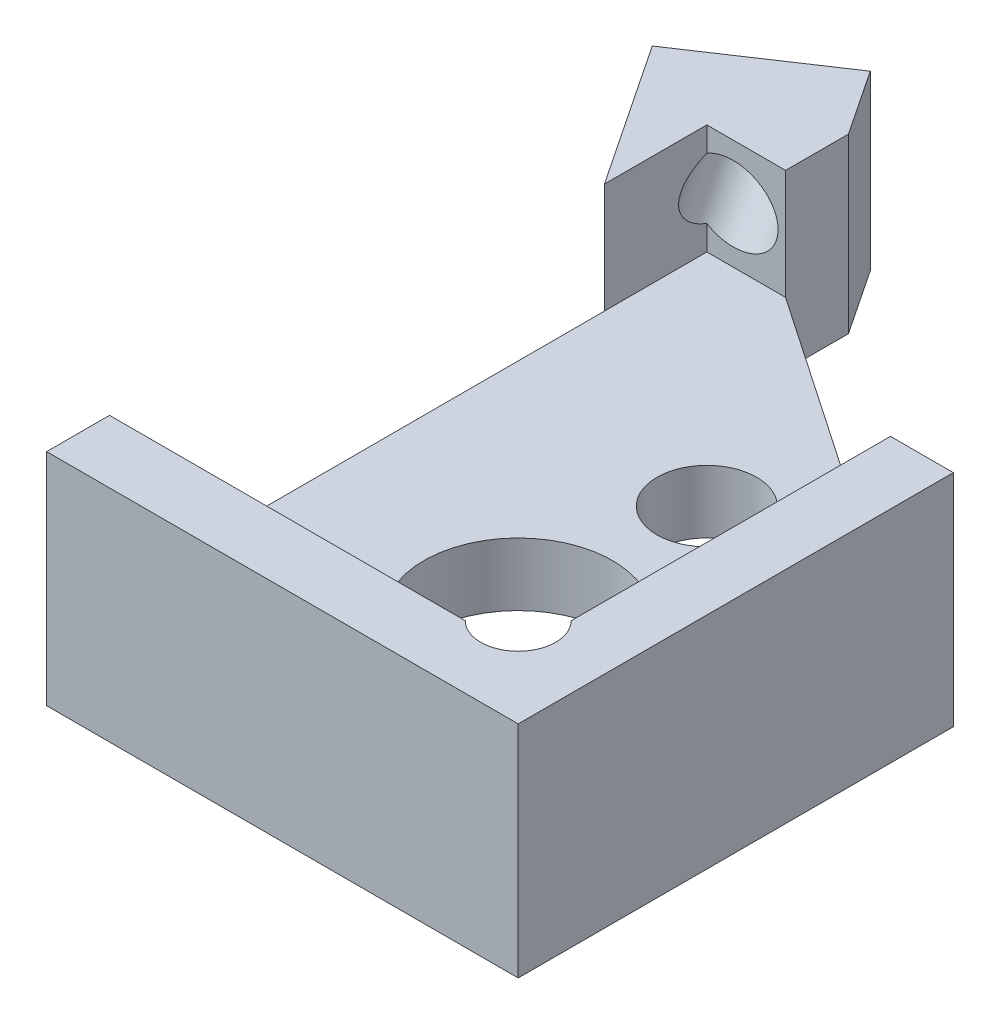
ISO-10303-21;
HEADER;
FILE_DESCRIPTION(('STEP AP214'),'2;1');
FILE_NAME('part.step','',(''),(''),'','','');
FILE_SCHEMA(('AUTOMOTIVE_DESIGN { 1 0 10303 214 1 1 1 1 }'));
ENDSEC;
DATA;
#1=APPLICATION_CONTEXT('core data for automotive mechanical design processes');
#2=APPLICATION_PROTOCOL_DEFINITION('international standard','automotive_design',2000,#1);
#3=PRODUCT_CONTEXT('',#1,'mechanical');
#4=PRODUCT('Part','Part','',(#3));
#5=PRODUCT_RELATED_PRODUCT_CATEGORY('part','',(#4));
#6=PRODUCT_DEFINITION_FORMATION('','',#4);
#7=PRODUCT_DEFINITION_CONTEXT('part definition',#1,'design');
#8=PRODUCT_DEFINITION('design','',#6,#7);
#9=PRODUCT_DEFINITION_SHAPE('','',#8);
#10=(LENGTH_UNIT() NAMED_UNIT(*) SI_UNIT(.MILLI.,.METRE.));
#11=(NAMED_UNIT(*) PLANE_ANGLE_UNIT() SI_UNIT($,.RADIAN.));
#12=(NAMED_UNIT(*) SI_UNIT($,.STERADIAN.) SOLID_ANGLE_UNIT());
#13=UNCERTAINTY_MEASURE_WITH_UNIT(LENGTH_MEASURE(1.E-05),#10,'distance_accuracy_value','');
#14=(GEOMETRIC_REPRESENTATION_CONTEXT(3) GLOBAL_UNCERTAINTY_ASSIGNED_CONTEXT((#13)) GLOBAL_UNIT_ASSIGNED_CONTEXT((#10,
#11,#12)) REPRESENTATION_CONTEXT('',''));
#15=CARTESIAN_POINT('',(0.,0.,0.));
#16=DIRECTION('',(0.,0.,1.));
#17=DIRECTION('',(1.,0.,0.));
#18=AXIS2_PLACEMENT_3D('',#15,#16,#17);
#19=CARTESIAN_POINT('',(4.25,3.5,5.75));
#20=DIRECTION('',(0.,0.,-1.));
#21=DIRECTION('',(-1.,0.,0.));
#22=AXIS2_PLACEMENT_3D('',#19,#20,#21);
#23=PLANE('',#22);
#24=DIRECTION('',(1.,0.,0.));
#25=VECTOR('',#24,1.);
#26=CARTESIAN_POINT('',(4.25,3.5,5.75));
#27=LINE('',#26,#25);
#28=CARTESIAN_POINT('',(-3.25,3.5,5.75));
#29=VERTEX_POINT('',#28);
#30=CARTESIAN_POINT('',(4.25,3.5,5.75));
#31=VERTEX_POINT('',#30);
#32=EDGE_CURVE('E282',#29,#31,#27,.T.);
#33=ORIENTED_EDGE('',*,*,#32,.F.);
#34=DIRECTION('',(0.,1.,0.));
#35=VECTOR('',#34,1.);
#36=CARTESIAN_POINT('',(-3.25,-0.001000000000001,5.75));
#37=LINE('',#36,#35);
#38=CARTESIAN_POINT('',(-3.25,0.,5.75));
#39=VERTEX_POINT('',#38);
#40=EDGE_CURVE('E173',#39,#29,#37,.T.);
#41=ORIENTED_EDGE('',*,*,#40,.F.);
#42=DIRECTION('',(1.,0.,0.));
#43=VECTOR('',#42,1.);
#44=CARTESIAN_POINT('',(4.25,0.,5.75));
#45=LINE('',#44,#43);
#46=CARTESIAN_POINT('',(4.25,0.,5.75));
#47=VERTEX_POINT('',#46);
#48=EDGE_CURVE('E170',#39,#47,#45,.T.);
#49=ORIENTED_EDGE('',*,*,#48,.T.);
#50=DIRECTION('',(0.,-1.,0.));
#51=VECTOR('',#50,1.);
#52=CARTESIAN_POINT('',(4.25,3.5,5.75));
#53=LINE('',#52,#51);
#54=EDGE_CURVE('E288',#31,#47,#53,.T.);
#55=ORIENTED_EDGE('',*,*,#54,.F.);
#56=EDGE_LOOP('',(#33,#41,#49,#55));
#57=FACE_BOUND('',#56,.T.);
#58=ADVANCED_FACE('F36',(#57),#23,.F.);
#59=CARTESIAN_POINT('',(4.25,3.5,-5.75));
#60=DIRECTION('',(-1.,0.,0.));
#61=DIRECTION('',(0.,0.,1.));
#62=AXIS2_PLACEMENT_3D('',#59,#60,#61);
#63=PLANE('',#62);
#64=DIRECTION('',(0.,0.,-1.));
#65=VECTOR('',#64,1.);
#66=CARTESIAN_POINT('',(4.25,0.,-5.75));
#67=LINE('',#66,#65);
#68=CARTESIAN_POINT('',(4.25,0.,-1.17080631760558));
#69=VERTEX_POINT('',#68);
#70=EDGE_CURVE('E285',#47,#69,#67,.T.);
#71=ORIENTED_EDGE('',*,*,#70,.T.);
#72=DIRECTION('',(0.,1.,0.));
#73=VECTOR('',#72,1.);
#74=CARTESIAN_POINT('',(4.25,-0.001000000000001,-1.17080631760558));
#75=LINE('',#74,#73);
#76=CARTESIAN_POINT('',(4.25,3.5,-1.17080631760558));
#77=VERTEX_POINT('',#76);
#78=EDGE_CURVE('E192',#69,#77,#75,.T.);
#79=ORIENTED_EDGE('',*,*,#78,.T.);
#80=DIRECTION('',(0.,0.,-1.));
#81=VECTOR('',#80,1.);
#82=CARTESIAN_POINT('',(4.25,3.5,-5.75));
#83=LINE('',#82,#81);
#84=EDGE_CURVE('E284',#31,#77,#83,.T.);
#85=ORIENTED_EDGE('',*,*,#84,.F.);
#86=ORIENTED_EDGE('',*,*,#54,.T.);
#87=EDGE_LOOP('',(#71,#79,#85,#86));
#88=FACE_BOUND('',#87,.T.);
#89=ADVANCED_FACE('F321',(#88),#63,.F.);
#90=CARTESIAN_POINT('',(0.,3.5,0.));
#91=DIRECTION('',(0.,-1.,0.));
#92=DIRECTION('',(0.,0.,-1.));
#93=AXIS2_PLACEMENT_3D('',#90,#91,#92);
#94=PLANE('',#93);
#95=DIRECTION('',(1.,0.,0.));
#96=VECTOR('',#95,1.);
#97=CARTESIAN_POINT('',(3.25,3.5,4.75));
#98=LINE('',#97,#96);
#99=CARTESIAN_POINT('',(-3.25,3.5,4.75));
#100=VERTEX_POINT('',#99);
#101=CARTESIAN_POINT('',(2.40810098864977,3.5,4.75));
#102=VERTEX_POINT('',#101);
#103=EDGE_CURVE('E256',#100,#102,#98,.T.);
#104=ORIENTED_EDGE('',*,*,#103,.F.);
#105=DIRECTION('',(0.,0.,-1.));
#106=VECTOR('',#105,1.);
#107=CARTESIAN_POINT('',(-3.25,3.5,-3.12166032803723));
#108=LINE('',#107,#106);
#109=EDGE_CURVE('E171',#29,#100,#108,.T.);
#110=ORIENTED_EDGE('',*,*,#109,.F.);
#111=ORIENTED_EDGE('',*,*,#32,.T.);
#112=ORIENTED_EDGE('',*,*,#84,.T.);
#113=DIRECTION('',(1.,0.,0.));
#114=VECTOR('',#113,1.);
#115=CARTESIAN_POINT('',(3.25,3.5,-1.17080631760558));
#116=LINE('',#115,#114);
#117=CARTESIAN_POINT('',(3.25,3.5,-1.17080631760558));
#118=VERTEX_POINT('',#117);
#119=EDGE_CURVE('E189',#118,#77,#116,.T.);
#120=ORIENTED_EDGE('',*,*,#119,.F.);
#121=DIRECTION('',(0.,0.,-1.));
#122=VECTOR('',#121,1.);
#123=CARTESIAN_POINT('',(3.25,3.5,-4.75));
#124=LINE('',#123,#122);
#125=CARTESIAN_POINT('',(3.25,3.5,3.90810098864977));
#126=VERTEX_POINT('',#125);
#127=EDGE_CURVE('E259',#126,#118,#124,.T.);
#128=ORIENTED_EDGE('',*,*,#127,.F.);
#129=CARTESIAN_POINT('',(2.82905049432488,3.5,4.32905049432488));
#130=DIRECTION('',(0.,1.,0.));
#131=DIRECTION('',(0.,0.,1.));
#132=AXIS2_PLACEMENT_3D('',#129,#130,#131);
#133=CIRCLE('',#132,0.595312500000001);
#134=EDGE_CURVE('E243',#102,#126,#133,.T.);
#135=ORIENTED_EDGE('',*,*,#134,.F.);
#136=EDGE_LOOP('',(#104,#110,#111,#112,#120,#128,#135));
#137=FACE_BOUND('',#136,.T.);
#138=ADVANCED_FACE('F329',(#137),#94,.F.);
#139=CARTESIAN_POINT('',(0.,0.,0.));
#140=DIRECTION('',(0.,-1.,0.));
#141=DIRECTION('',(0.,0.,-1.));
#142=AXIS2_PLACEMENT_3D('',#139,#140,#141);
#143=PLANE('',#142);
#144=DIRECTION('',(0.,0.,-1.));
#145=VECTOR('',#144,1.);
#146=CARTESIAN_POINT('',(-3.25,0.,-3.12166032803723));
#147=LINE('',#146,#145);
#148=CARTESIAN_POINT('',(-3.25,0.,-3.12166032803723));
#149=VERTEX_POINT('',#148);
#150=EDGE_CURVE('E160',#39,#149,#147,.T.);
#151=ORIENTED_EDGE('',*,*,#150,.T.);
#152=DIRECTION('',(0.55470019622523,0.,0.832050294337843));
#153=VECTOR('',#152,1.);
#154=CARTESIAN_POINT('',(-4.00154138705974,0.,-4.24897240862684));
#155=LINE('',#154,#153);
#156=CARTESIAN_POINT('',(-4.77077215629051,0.,-5.40281856247299));
#157=VERTEX_POINT('',#156);
#158=EDGE_CURVE('E146',#157,#149,#155,.T.);
#159=ORIENTED_EDGE('',*,*,#158,.F.);
#160=DIRECTION('',(-0.832050294337844,0.,0.554700196225229));
#161=VECTOR('',#160,1.);
#162=CARTESIAN_POINT('',(-2.6906464204459,0.,-6.78956905303607));
#163=LINE('',#162,#161);
#164=CARTESIAN_POINT('',(-2.6906464204459,0.,-6.78956905303607));
#165=VERTEX_POINT('',#164);
#166=EDGE_CURVE('E218',#165,#157,#163,.T.);
#167=ORIENTED_EDGE('',*,*,#166,.F.);
#168=DIRECTION('',(-0.554700196225229,0.,-0.832050294337844));
#169=VECTOR('',#168,1.);
#170=CARTESIAN_POINT('',(-2.6906464204459,0.,-6.78956905303607));
#171=LINE('',#170,#169);
#172=CARTESIAN_POINT('',(-1.99760038508853,0.,-5.75));
#173=VERTEX_POINT('',#172);
#174=EDGE_CURVE('E156',#173,#165,#171,.T.);
#175=ORIENTED_EDGE('',*,*,#174,.F.);
#176=DIRECTION('',(0.,0.,1.));
#177=VECTOR('',#176,1.);
#178=CARTESIAN_POINT('',(-1.99760038508852,0.,-5.75));
#179=LINE('',#178,#177);
#180=CARTESIAN_POINT('',(-1.99760038508852,0.,-4.75));
#181=VERTEX_POINT('',#180);
#182=EDGE_CURVE('E200',#173,#181,#179,.T.);
#183=ORIENTED_EDGE('',*,*,#182,.T.);
#184=DIRECTION('',(0.826133221814283,0.,0.563474843994613));
#185=VECTOR('',#184,1.);
#186=CARTESIAN_POINT('',(-1.99760038508852,0.,-4.75));
#187=LINE('',#186,#185);
#188=CARTESIAN_POINT('',(3.25,0.,-1.17080631760558));
#189=VERTEX_POINT('',#188);
#190=EDGE_CURVE('E183',#181,#189,#187,.T.);
#191=ORIENTED_EDGE('',*,*,#190,.T.);
#192=DIRECTION('',(1.,0.,0.));
#193=VECTOR('',#192,1.);
#194=CARTESIAN_POINT('',(3.25,0.,-1.17080631760558));
#195=LINE('',#194,#193);
#196=EDGE_CURVE('E186',#189,#69,#195,.T.);
#197=ORIENTED_EDGE('',*,*,#196,.T.);
#198=ORIENTED_EDGE('',*,*,#70,.F.);
#199=ORIENTED_EDGE('',*,*,#48,.F.);
#200=EDGE_LOOP('',(#151,#159,#167,#175,#183,#191,#197,#198,#199));
#201=FACE_BOUND('',#200,.T.);
#202=CARTESIAN_POINT('',(2.125,0.,3.5));
#203=DIRECTION('',(0.,1.,0.));
#204=DIRECTION('',(0.,0.,1.));
#205=AXIS2_PLACEMENT_3D('',#202,#203,#204);
#206=CIRCLE('',#205,0.79375);
#207=CARTESIAN_POINT('',(2.125,0.,4.29375));
#208=VERTEX_POINT('',#207);
#209=EDGE_CURVE('E228',#208,#208,#206,.T.);
#210=ORIENTED_EDGE('',*,*,#209,.T.);
#211=EDGE_LOOP('',(#210));
#212=FACE_BOUND('',#211,.T.);
#213=CARTESIAN_POINT('',(-1.625,0.,3.5));
#214=DIRECTION('',(0.,1.,0.));
#215=DIRECTION('',(0.,0.,1.));
#216=AXIS2_PLACEMENT_3D('',#213,#214,#215);
#217=CIRCLE('',#216,0.793750000000001);
#218=CARTESIAN_POINT('',(-1.625,0.,4.29375));
#219=VERTEX_POINT('',#218);
#220=EDGE_CURVE('E234',#219,#219,#217,.T.);
#221=ORIENTED_EDGE('',*,*,#220,.T.);
#222=EDGE_LOOP('',(#221));
#223=FACE_BOUND('',#222,.T.);
#224=CARTESIAN_POINT('',(0.250000000000001,0.,-1.25));
#225=DIRECTION('',(0.,1.,0.));
#226=DIRECTION('',(0.,0.,1.));
#227=AXIS2_PLACEMENT_3D('',#224,#225,#226);
#228=CIRCLE('',#227,0.79375);
#229=CARTESIAN_POINT('',(0.250000000000001,0.,-0.456249999999999));
#230=VERTEX_POINT('',#229);
#231=EDGE_CURVE('E240',#230,#230,#228,.T.);
#232=ORIENTED_EDGE('',*,*,#231,.T.);
#233=EDGE_LOOP('',(#232));
#234=FACE_BOUND('',#233,.T.);
#235=CARTESIAN_POINT('',(0.250000000000001,0.,1.75));
#236=DIRECTION('',(0.,1.,0.));
#237=DIRECTION('',(0.,0.,1.));
#238=AXIS2_PLACEMENT_3D('',#235,#236,#237);
#239=CIRCLE('',#238,1.5);
#240=CARTESIAN_POINT('',(0.250000000000001,0.,3.25));
#241=VERTEX_POINT('',#240);
#242=EDGE_CURVE('E253',#241,#241,#239,.T.);
#243=ORIENTED_EDGE('',*,*,#242,.T.);
#244=EDGE_LOOP('',(#243));
#245=FACE_BOUND('',#244,.T.);
#246=ADVANCED_FACE('F167',(#201,#212,#223,#234,#245),#143,.T.);
#247=CARTESIAN_POINT('',(0.,1.,0.));
#248=DIRECTION('',(0.,-1.,0.));
#249=DIRECTION('',(0.,0.,-1.));
#250=AXIS2_PLACEMENT_3D('',#247,#248,#249);
#251=PLANE('',#250);
#252=CARTESIAN_POINT('',(2.125,1.,3.5));
#253=DIRECTION('',(0.,1.,0.));
#254=DIRECTION('',(0.,0.,1.));
#255=AXIS2_PLACEMENT_3D('',#252,#253,#254);
#256=CIRCLE('',#255,0.79375);
#257=CARTESIAN_POINT('',(2.125,1.,4.29375));
#258=VERTEX_POINT('',#257);
#259=EDGE_CURVE('E227',#258,#258,#256,.T.);
#260=ORIENTED_EDGE('',*,*,#259,.F.);
#261=EDGE_LOOP('',(#260));
#262=FACE_BOUND('',#261,.T.);
#263=CARTESIAN_POINT('',(-1.625,1.,3.5));
#264=DIRECTION('',(0.,1.,0.));
#265=DIRECTION('',(0.,0.,1.));
#266=AXIS2_PLACEMENT_3D('',#263,#264,#265);
#267=CIRCLE('',#266,0.793750000000001);
#268=CARTESIAN_POINT('',(-1.625,1.,4.29375));
#269=VERTEX_POINT('',#268);
#270=EDGE_CURVE('E231',#269,#269,#267,.T.);
#271=ORIENTED_EDGE('',*,*,#270,.F.);
#272=EDGE_LOOP('',(#271));
#273=FACE_BOUND('',#272,.T.);
#274=CARTESIAN_POINT('',(0.250000000000001,1.,-1.25));
#275=DIRECTION('',(0.,1.,0.));
#276=DIRECTION('',(0.,0.,1.));
#277=AXIS2_PLACEMENT_3D('',#274,#275,#276);
#278=CIRCLE('',#277,0.79375);
#279=CARTESIAN_POINT('',(0.250000000000001,1.,-0.456249999999999));
#280=VERTEX_POINT('',#279);
#281=EDGE_CURVE('E237',#280,#280,#278,.T.);
#282=ORIENTED_EDGE('',*,*,#281,.F.);
#283=EDGE_LOOP('',(#282));
#284=FACE_BOUND('',#283,.T.);
#285=CARTESIAN_POINT('',(0.250000000000001,1.,1.75));
#286=DIRECTION('',(0.,1.,0.));
#287=DIRECTION('',(0.,0.,1.));
#288=AXIS2_PLACEMENT_3D('',#285,#286,#287);
#289=CIRCLE('',#288,1.5);
#290=CARTESIAN_POINT('',(0.250000000000001,1.,3.25));
#291=VERTEX_POINT('',#290);
#292=EDGE_CURVE('E252',#291,#291,#289,.T.);
#293=ORIENTED_EDGE('',*,*,#292,.F.);
#294=EDGE_LOOP('',(#293));
#295=FACE_BOUND('',#294,.T.);
#296=DIRECTION('',(0.,0.,-1.));
#297=VECTOR('',#296,1.);
#298=CARTESIAN_POINT('',(3.25,1.,-4.75));
#299=LINE('',#298,#297);
#300=CARTESIAN_POINT('',(3.25,1.,3.90810098864977));
#301=VERTEX_POINT('',#300);
#302=CARTESIAN_POINT('',(3.25,1.,-1.17080631760558));
#303=VERTEX_POINT('',#302);
#304=EDGE_CURVE('E267',#301,#303,#299,.T.);
#305=ORIENTED_EDGE('',*,*,#304,.T.);
#306=DIRECTION('',(0.826133221814283,0.,0.563474843994613));
#307=VECTOR('',#306,1.);
#308=CARTESIAN_POINT('',(-1.99760038508852,1.,-4.75));
#309=LINE('',#308,#307);
#310=CARTESIAN_POINT('',(-1.99760038508852,1.,-4.75));
#311=VERTEX_POINT('',#310);
#312=EDGE_CURVE('E203',#311,#303,#309,.T.);
#313=ORIENTED_EDGE('',*,*,#312,.F.);
#314=DIRECTION('',(-1.,0.,0.));
#315=VECTOR('',#314,1.);
#316=CARTESIAN_POINT('',(3.25,1.,-4.75));
#317=LINE('',#316,#315);
#318=CARTESIAN_POINT('',(-3.25,1.,-4.75));
#319=VERTEX_POINT('',#318);
#320=EDGE_CURVE('E273',#311,#319,#317,.T.);
#321=ORIENTED_EDGE('',*,*,#320,.T.);
#322=DIRECTION('',(0.,0.,1.));
#323=VECTOR('',#322,1.);
#324=CARTESIAN_POINT('',(-3.25,1.,-4.75));
#325=LINE('',#324,#323);
#326=CARTESIAN_POINT('',(-3.25,1.,-3.12166032803723));
#327=VERTEX_POINT('',#326);
#328=EDGE_CURVE('E268',#319,#327,#325,.T.);
#329=ORIENTED_EDGE('',*,*,#328,.T.);
#330=DIRECTION('',(0.,0.,1.));
#331=VECTOR('',#330,1.);
#332=CARTESIAN_POINT('',(-3.25,1.,0.));
#333=LINE('',#332,#331);
#334=CARTESIAN_POINT('',(-3.25,1.,4.75));
#335=VERTEX_POINT('',#334);
#336=EDGE_CURVE('E163',#327,#335,#333,.T.);
#337=ORIENTED_EDGE('',*,*,#336,.T.);
#338=DIRECTION('',(1.,0.,0.));
#339=VECTOR('',#338,1.);
#340=CARTESIAN_POINT('',(3.25,1.,4.75));
#341=LINE('',#340,#339);
#342=CARTESIAN_POINT('',(2.40810098864977,1.,4.75));
#343=VERTEX_POINT('',#342);
#344=EDGE_CURVE('E262',#335,#343,#341,.T.);
#345=ORIENTED_EDGE('',*,*,#344,.T.);
#346=CARTESIAN_POINT('',(2.82905049432488,1.,4.32905049432488));
#347=DIRECTION('',(0.,-1.,0.));
#348=DIRECTION('',(0.,0.,-1.));
#349=AXIS2_PLACEMENT_3D('',#346,#347,#348);
#350=CIRCLE('',#349,0.595312500000001);
#351=EDGE_CURVE('E247',#343,#301,#350,.F.);
#352=ORIENTED_EDGE('',*,*,#351,.T.);
#353=EDGE_LOOP('',(#305,#313,#321,#329,#337,#345,#352));
#354=FACE_BOUND('',#353,.T.);
#355=ADVANCED_FACE('F336',(#262,#273,#284,#295,#354),#251,.F.);
#356=CARTESIAN_POINT('',(3.25,-11.5108644332213,4.75));
#357=DIRECTION('',(0.,0.,1.));
#358=DIRECTION('',(1.,0.,0.));
#359=AXIS2_PLACEMENT_3D('',#356,#357,#358);
#360=PLANE('',#359);
#361=ORIENTED_EDGE('',*,*,#103,.T.);
#362=DIRECTION('',(0.,1.,0.));
#363=VECTOR('',#362,1.);
#364=CARTESIAN_POINT('',(2.40810098864977,-0.68379802270047,4.75));
#365=LINE('',#364,#363);
#366=EDGE_CURVE('E249',#102,#343,#365,.F.);
#367=ORIENTED_EDGE('',*,*,#366,.T.);
#368=ORIENTED_EDGE('',*,*,#344,.F.);
#369=DIRECTION('',(0.,1.,0.));
#370=VECTOR('',#369,1.);
#371=CARTESIAN_POINT('',(-3.25,-11.5108644332213,4.75));
#372=LINE('',#371,#370);
#373=EDGE_CURVE('E271',#335,#100,#372,.T.);
#374=ORIENTED_EDGE('',*,*,#373,.T.);
#375=EDGE_LOOP('',(#361,#367,#368,#374));
#376=FACE_BOUND('',#375,.T.);
#377=ADVANCED_FACE('F333',(#376),#360,.F.);
#378=CARTESIAN_POINT('',(3.25,-11.5108644332213,-4.75));
#379=DIRECTION('',(1.,0.,0.));
#380=DIRECTION('',(0.,0.,-1.));
#381=AXIS2_PLACEMENT_3D('',#378,#379,#380);
#382=PLANE('',#381);
#383=ORIENTED_EDGE('',*,*,#127,.T.);
#384=DIRECTION('',(0.,1.,0.));
#385=VECTOR('',#384,1.);
#386=CARTESIAN_POINT('',(3.25,-0.001000000000001,-1.17080631760558));
#387=LINE('',#386,#385);
#388=EDGE_CURVE('E181',#303,#118,#387,.T.);
#389=ORIENTED_EDGE('',*,*,#388,.F.);
#390=ORIENTED_EDGE('',*,*,#304,.F.);
#391=DIRECTION('',(0.,1.,0.));
#392=VECTOR('',#391,1.);
#393=CARTESIAN_POINT('',(3.25,-0.68379802270047,3.90810098864977));
#394=LINE('',#393,#392);
#395=EDGE_CURVE('E294',#301,#126,#394,.T.);
#396=ORIENTED_EDGE('',*,*,#395,.T.);
#397=EDGE_LOOP('',(#383,#389,#390,#396));
#398=FACE_BOUND('',#397,.T.);
#399=ADVANCED_FACE('F373',(#398),#382,.F.);
#400=CARTESIAN_POINT('',(3.25,-11.5108644332213,-4.75));
#401=DIRECTION('',(0.,0.,-1.));
#402=DIRECTION('',(-1.,0.,0.));
#403=AXIS2_PLACEMENT_3D('',#400,#401,#402);
#404=PLANE('',#403);
#405=ORIENTED_EDGE('',*,*,#320,.F.);
#406=DIRECTION('',(0.,-1.,0.));
#407=VECTOR('',#406,1.);
#408=CARTESIAN_POINT('',(-1.99760038508852,-0.001000000000001,-4.75));
#409=LINE('',#408,#407);
#410=CARTESIAN_POINT('',(-1.99760038508852,2.75,-4.75));
#411=VERTEX_POINT('',#410);
#412=EDGE_CURVE('E178',#411,#311,#409,.T.);
#413=ORIENTED_EDGE('',*,*,#412,.F.);
#414=DIRECTION('',(-1.,0.,0.));
#415=VECTOR('',#414,1.);
#416=CARTESIAN_POINT('',(3.25,2.75,-4.75));
#417=LINE('',#416,#415);
#418=CARTESIAN_POINT('',(-3.25,2.75,-4.75));
#419=VERTEX_POINT('',#418);
#420=EDGE_CURVE('E216',#411,#419,#417,.T.);
#421=ORIENTED_EDGE('',*,*,#420,.T.);
#422=DIRECTION('',(0.,1.,0.));
#423=VECTOR('',#422,1.);
#424=CARTESIAN_POINT('',(-3.25,-11.5108644332213,-4.75));
#425=LINE('',#424,#423);
#426=CARTESIAN_POINT('',(-3.25,2.35928589904809,-4.75));
#427=VERTEX_POINT('',#426);
#428=EDGE_CURVE('E275',#427,#419,#425,.T.);
#429=ORIENTED_EDGE('',*,*,#428,.F.);
#430=CARTESIAN_POINT('',(-2.83324674986519,1.875,-4.75));
#431=DIRECTION('',(0.,0.,-1.));
#432=DIRECTION('',(-1.,0.,0.));
#433=AXIS2_PLACEMENT_3D('',#430,#431,#432);
#434=ELLIPSE('',#433,0.715858168734871,0.595629999999999);
#435=CARTESIAN_POINT('',(-3.25,1.39071410095191,-4.75));
#436=VERTEX_POINT('',#435);
#437=EDGE_CURVE('E57',#427,#436,#434,.T.);
#438=ORIENTED_EDGE('',*,*,#437,.T.);
#439=EDGE_CURVE('E272',#319,#436,#425,.T.);
#440=ORIENTED_EDGE('',*,*,#439,.F.);
#441=EDGE_LOOP('',(#405,#413,#421,#429,#438,#440));
#442=FACE_BOUND('',#441,.T.);
#443=ADVANCED_FACE('F343',(#442),#404,.F.);
#444=CARTESIAN_POINT('',(-3.25,-11.5108644332213,-4.75));
#445=DIRECTION('',(-1.,0.,0.));
#446=DIRECTION('',(0.,0.,1.));
#447=AXIS2_PLACEMENT_3D('',#444,#445,#446);
#448=PLANE('',#447);
#449=DIRECTION('',(0.,0.,1.));
#450=VECTOR('',#449,1.);
#451=CARTESIAN_POINT('',(-3.25,2.75,-4.75));
#452=LINE('',#451,#450);
#453=CARTESIAN_POINT('',(-3.25,2.75,-3.12166032803723));
#454=VERTEX_POINT('',#453);
#455=EDGE_CURVE('E213',#419,#454,#452,.T.);
#456=ORIENTED_EDGE('',*,*,#455,.T.);
#457=DIRECTION('',(0.,1.,0.));
#458=VECTOR('',#457,1.);
#459=CARTESIAN_POINT('',(-3.25,-0.001000000000001,-3.12166032803723));
#460=LINE('',#459,#458);
#461=EDGE_CURVE('E164',#327,#454,#460,.T.);
#462=ORIENTED_EDGE('',*,*,#461,.F.);
#463=ORIENTED_EDGE('',*,*,#328,.F.);
#464=ORIENTED_EDGE('',*,*,#439,.T.);
#465=CARTESIAN_POINT('',(-3.25,1.875,-5.37512987520222));
#466=DIRECTION('',(-1.,0.,0.));
#467=DIRECTION('',(0.,0.,-1.));
#468=AXIS2_PLACEMENT_3D('',#465,#466,#467);
#469=ELLIPSE('',#468,1.0737872531023,0.595629999999999);
#470=EDGE_CURVE('E13',#436,#427,#469,.T.);
#471=ORIENTED_EDGE('',*,*,#470,.T.);
#472=ORIENTED_EDGE('',*,*,#428,.T.);
#473=EDGE_LOOP('',(#456,#462,#463,#464,#471,#472));
#474=FACE_BOUND('',#473,.T.);
#475=ADVANCED_FACE('F341',(#474),#448,.F.);
#476=CARTESIAN_POINT('',(0.250000000000001,0.,1.75));
#477=DIRECTION('',(0.,1.,0.));
#478=DIRECTION('',(0.,0.,1.));
#479=AXIS2_PLACEMENT_3D('',#476,#477,#478);
#480=CYLINDRICAL_SURFACE('',#479,1.5);
#481=ORIENTED_EDGE('',*,*,#242,.F.);
#482=EDGE_LOOP('',(#481));
#483=FACE_BOUND('',#482,.T.);
#484=ORIENTED_EDGE('',*,*,#292,.T.);
#485=EDGE_LOOP('',(#484));
#486=FACE_BOUND('',#485,.T.);
#487=ADVANCED_FACE('F381',(#483,#486),#480,.F.);
#488=CARTESIAN_POINT('',(2.82905049432488,-0.68379802270047,4.32905049432488));
#489=DIRECTION('',(0.,1.,0.));
#490=DIRECTION('',(0.,0.,1.));
#491=AXIS2_PLACEMENT_3D('',#488,#489,#490);
#492=CYLINDRICAL_SURFACE('',#491,0.595312500000001);
#493=ORIENTED_EDGE('',*,*,#134,.T.);
#494=ORIENTED_EDGE('',*,*,#395,.F.);
#495=ORIENTED_EDGE('',*,*,#351,.F.);
#496=ORIENTED_EDGE('',*,*,#366,.F.);
#497=EDGE_LOOP('',(#493,#494,#495,#496));
#498=FACE_BOUND('',#497,.T.);
#499=ADVANCED_FACE('F384',(#498),#492,.F.);
#500=CARTESIAN_POINT('',(0.250000000000001,0.,-1.25));
#501=DIRECTION('',(0.,1.,0.));
#502=DIRECTION('',(0.,0.,1.));
#503=AXIS2_PLACEMENT_3D('',#500,#501,#502);
#504=CYLINDRICAL_SURFACE('',#503,0.79375);
#505=ORIENTED_EDGE('',*,*,#231,.F.);
#506=EDGE_LOOP('',(#505));
#507=FACE_BOUND('',#506,.T.);
#508=ORIENTED_EDGE('',*,*,#281,.T.);
#509=EDGE_LOOP('',(#508));
#510=FACE_BOUND('',#509,.T.);
#511=ADVANCED_FACE('F388',(#507,#510),#504,.F.);
#512=CARTESIAN_POINT('',(-1.625,0.,3.5));
#513=DIRECTION('',(0.,1.,0.));
#514=DIRECTION('',(0.,0.,1.));
#515=AXIS2_PLACEMENT_3D('',#512,#513,#514);
#516=CYLINDRICAL_SURFACE('',#515,0.793750000000001);
#517=ORIENTED_EDGE('',*,*,#220,.F.);
#518=EDGE_LOOP('',(#517));
#519=FACE_BOUND('',#518,.T.);
#520=ORIENTED_EDGE('',*,*,#270,.T.);
#521=EDGE_LOOP('',(#520));
#522=FACE_BOUND('',#521,.T.);
#523=ADVANCED_FACE('F392',(#519,#522),#516,.F.);
#524=CARTESIAN_POINT('',(2.125,0.,3.5));
#525=DIRECTION('',(0.,1.,0.));
#526=DIRECTION('',(0.,0.,1.));
#527=AXIS2_PLACEMENT_3D('',#524,#525,#526);
#528=CYLINDRICAL_SURFACE('',#527,0.79375);
#529=ORIENTED_EDGE('',*,*,#209,.F.);
#530=EDGE_LOOP('',(#529));
#531=FACE_BOUND('',#530,.T.);
#532=ORIENTED_EDGE('',*,*,#259,.T.);
#533=EDGE_LOOP('',(#532));
#534=FACE_BOUND('',#533,.T.);
#535=ADVANCED_FACE('F396',(#531,#534),#528,.F.);
#536=CARTESIAN_POINT('',(-2.6906464204459,-3.81752063551709,-6.78956905303607));
#537=DIRECTION('',(-0.554700196225229,0.,-0.832050294337843));
#538=DIRECTION('',(-0.832050294337844,0.,0.554700196225229));
#539=AXIS2_PLACEMENT_3D('',#536,#537,#538);
#540=PLANE('',#539);
#541=CARTESIAN_POINT('',(-3.73070928836821,1.875,-6.09619380775453));
#542=DIRECTION('',(-0.55470019622523,0.,-0.832050294337843));
#543=DIRECTION('',(-0.832050294337843,0.,0.55470019622523));
#544=AXIS2_PLACEMENT_3D('',#541,#542,#543);
#545=CIRCLE('',#544,0.595629999999999);
#546=CARTESIAN_POINT('',(-4.22630340518466,1.875,-5.7657977298769));
#547=VERTEX_POINT('',#546);
#548=EDGE_CURVE('E206',#547,#547,#545,.T.);
#549=ORIENTED_EDGE('',*,*,#548,.F.);
#550=EDGE_LOOP('',(#549));
#551=FACE_BOUND('',#550,.T.);
#552=DIRECTION('',(-0.832050294337844,0.,0.554700196225229));
#553=VECTOR('',#552,1.);
#554=CARTESIAN_POINT('',(-2.6906464204459,2.75,-6.78956905303607));
#555=LINE('',#554,#553);
#556=CARTESIAN_POINT('',(-2.6906464204459,2.75,-6.78956905303607));
#557=VERTEX_POINT('',#556);
#558=CARTESIAN_POINT('',(-4.77077215629051,2.75,-5.40281856247299));
#559=VERTEX_POINT('',#558);
#560=EDGE_CURVE('E210',#557,#559,#555,.T.);
#561=ORIENTED_EDGE('',*,*,#560,.F.);
#562=DIRECTION('',(0.,1.,0.));
#563=VECTOR('',#562,1.);
#564=CARTESIAN_POINT('',(-2.6906464204459,-3.81752063551709,-6.78956905303607));
#565=LINE('',#564,#563);
#566=EDGE_CURVE('E220',#165,#557,#565,.T.);
#567=ORIENTED_EDGE('',*,*,#566,.F.);
#568=ORIENTED_EDGE('',*,*,#166,.T.);
#569=DIRECTION('',(0.,1.,0.));
#570=VECTOR('',#569,1.);
#571=CARTESIAN_POINT('',(-4.77077215629051,-3.81752063551709,-5.40281856247299));
#572=LINE('',#571,#570);
#573=EDGE_CURVE('E152',#157,#559,#572,.T.);
#574=ORIENTED_EDGE('',*,*,#573,.T.);
#575=EDGE_LOOP('',(#561,#567,#568,#574));
#576=FACE_BOUND('',#575,.T.);
#577=ADVANCED_FACE('F305',(#551,#576),#540,.T.);
#578=CARTESIAN_POINT('',(-4.00154138705974,-3.81752063551709,-4.24897240862684));
#579=DIRECTION('',(-0.832050294337843,0.,0.55470019622523));
#580=DIRECTION('',(0.55470019622523,0.,0.832050294337843));
#581=AXIS2_PLACEMENT_3D('',#578,#579,#580);
#582=PLANE('',#581);
#583=DIRECTION('',(0.55470019622523,0.,0.832050294337843));
#584=VECTOR('',#583,1.);
#585=CARTESIAN_POINT('',(-4.00154138705974,2.75,-4.24897240862684));
#586=LINE('',#585,#584);
#587=EDGE_CURVE('E50',#559,#454,#586,.T.);
#588=ORIENTED_EDGE('',*,*,#587,.F.);
#589=ORIENTED_EDGE('',*,*,#573,.F.);
#590=ORIENTED_EDGE('',*,*,#158,.T.);
#591=EDGE_CURVE('E149',#149,#327,#460,.T.);
#592=ORIENTED_EDGE('',*,*,#591,.T.);
#593=ORIENTED_EDGE('',*,*,#461,.T.);
#594=EDGE_LOOP('',(#588,#589,#590,#592,#593));
#595=FACE_BOUND('',#594,.T.);
#596=ADVANCED_FACE('F148',(#595),#582,.T.);
#597=CARTESIAN_POINT('',(-2.6906464204459,-3.81752063551709,-6.78956905303607));
#598=DIRECTION('',(0.832050294337844,0.,-0.554700196225229));
#599=DIRECTION('',(-0.554700196225229,0.,-0.832050294337844));
#600=AXIS2_PLACEMENT_3D('',#597,#598,#599);
#601=PLANE('',#600);
#602=DIRECTION('',(-0.554700196225229,0.,-0.832050294337844));
#603=VECTOR('',#602,1.);
#604=CARTESIAN_POINT('',(-2.6906464204459,2.75,-6.78956905303607));
#605=LINE('',#604,#603);
#606=CARTESIAN_POINT('',(-1.99760038508853,2.75,-5.75));
#607=VERTEX_POINT('',#606);
#608=EDGE_CURVE('E43',#607,#557,#605,.T.);
#609=ORIENTED_EDGE('',*,*,#608,.F.);
#610=DIRECTION('',(0.,1.,0.));
#611=VECTOR('',#610,1.);
#612=CARTESIAN_POINT('',(-1.99760038508853,3.5,-5.75));
#613=LINE('',#612,#611);
#614=EDGE_CURVE('E225',#173,#607,#613,.T.);
#615=ORIENTED_EDGE('',*,*,#614,.F.);
#616=ORIENTED_EDGE('',*,*,#174,.T.);
#617=ORIENTED_EDGE('',*,*,#566,.T.);
#618=EDGE_LOOP('',(#609,#615,#616,#617));
#619=FACE_BOUND('',#618,.T.);
#620=ADVANCED_FACE('F306',(#619),#601,.T.);
#621=CARTESIAN_POINT('',(0.,2.75,0.));
#622=DIRECTION('',(0.,-1.,0.));
#623=DIRECTION('',(0.,0.,-1.));
#624=AXIS2_PLACEMENT_3D('',#621,#622,#623);
#625=PLANE('',#624);
#626=ORIENTED_EDGE('',*,*,#587,.T.);
#627=ORIENTED_EDGE('',*,*,#455,.F.);
#628=ORIENTED_EDGE('',*,*,#420,.F.);
#629=DIRECTION('',(0.,0.,1.));
#630=VECTOR('',#629,1.);
#631=CARTESIAN_POINT('',(-1.99760038508852,2.75,-5.75));
#632=LINE('',#631,#630);
#633=EDGE_CURVE('E195',#607,#411,#632,.T.);
#634=ORIENTED_EDGE('',*,*,#633,.F.);
#635=ORIENTED_EDGE('',*,*,#608,.T.);
#636=ORIENTED_EDGE('',*,*,#560,.T.);
#637=EDGE_LOOP('',(#626,#627,#628,#634,#635,#636));
#638=FACE_BOUND('',#637,.T.);
#639=ADVANCED_FACE('F299',(#638),#625,.F.);
#640=CARTESIAN_POINT('',(-3.73070928836821,1.875,-6.09619380775453));
#641=DIRECTION('',(-0.55470019622523,0.,-0.832050294337843));
#642=DIRECTION('',(-0.832050294337843,0.,0.55470019622523));
#643=AXIS2_PLACEMENT_3D('',#640,#641,#642);
#644=CYLINDRICAL_SURFACE('',#643,0.595629999999999);
#645=ORIENTED_EDGE('',*,*,#548,.T.);
#646=EDGE_LOOP('',(#645));
#647=FACE_BOUND('',#646,.T.);
#648=ORIENTED_EDGE('',*,*,#470,.F.);
#649=ORIENTED_EDGE('',*,*,#437,.F.);
#650=EDGE_LOOP('',(#648,#649));
#651=FACE_BOUND('',#650,.T.);
#652=ADVANCED_FACE('F346',(#647,#651),#644,.F.);
#653=CARTESIAN_POINT('',(-1.99760038508852,-0.001000000000001,-4.75));
#654=DIRECTION('',(-0.563474843994613,0.,0.826133221814283));
#655=DIRECTION('',(0.826133221814283,0.,0.563474843994613));
#656=AXIS2_PLACEMENT_3D('',#653,#654,#655);
#657=PLANE('',#656);
#658=DIRECTION('',(0.,1.,0.));
#659=VECTOR('',#658,1.);
#660=CARTESIAN_POINT('',(-1.99760038508852,-0.001000000000001,-4.75));
#661=LINE('',#660,#659);
#662=EDGE_CURVE('E191',#181,#311,#661,.T.);
#663=ORIENTED_EDGE('',*,*,#662,.T.);
#664=ORIENTED_EDGE('',*,*,#312,.T.);
#665=DIRECTION('',(0.,1.,0.));
#666=VECTOR('',#665,1.);
#667=CARTESIAN_POINT('',(3.25,-0.001000000000001,-1.17080631760558));
#668=LINE('',#667,#666);
#669=EDGE_CURVE('E196',#189,#303,#668,.T.);
#670=ORIENTED_EDGE('',*,*,#669,.F.);
#671=ORIENTED_EDGE('',*,*,#190,.F.);
#672=EDGE_LOOP('',(#663,#664,#670,#671));
#673=FACE_BOUND('',#672,.T.);
#674=ADVANCED_FACE('F314',(#673),#657,.F.);
#675=CARTESIAN_POINT('',(-1.99760038508852,-0.001000000000001,-5.75));
#676=DIRECTION('',(-1.,0.,0.));
#677=DIRECTION('',(0.,0.,1.));
#678=AXIS2_PLACEMENT_3D('',#675,#676,#677);
#679=PLANE('',#678);
#680=ORIENTED_EDGE('',*,*,#614,.T.);
#681=ORIENTED_EDGE('',*,*,#633,.T.);
#682=ORIENTED_EDGE('',*,*,#412,.T.);
#683=ORIENTED_EDGE('',*,*,#662,.F.);
#684=ORIENTED_EDGE('',*,*,#182,.F.);
#685=EDGE_LOOP('',(#680,#681,#682,#683,#684));
#686=FACE_BOUND('',#685,.T.);
#687=ADVANCED_FACE('F310',(#686),#679,.F.);
#688=CARTESIAN_POINT('',(3.25,-0.001000000000001,-1.17080631760558));
#689=DIRECTION('',(0.,0.,1.));
#690=DIRECTION('',(1.,0.,0.));
#691=AXIS2_PLACEMENT_3D('',#688,#689,#690);
#692=PLANE('',#691);
#693=ORIENTED_EDGE('',*,*,#669,.T.);
#694=ORIENTED_EDGE('',*,*,#388,.T.);
#695=ORIENTED_EDGE('',*,*,#119,.T.);
#696=ORIENTED_EDGE('',*,*,#78,.F.);
#697=ORIENTED_EDGE('',*,*,#196,.F.);
#698=EDGE_LOOP('',(#693,#694,#695,#696,#697));
#699=FACE_BOUND('',#698,.T.);
#700=ADVANCED_FACE('F318',(#699),#692,.F.);
#701=CARTESIAN_POINT('',(-3.25,-0.001000000000001,-3.12166032803723));
#702=DIRECTION('',(1.,0.,0.));
#703=DIRECTION('',(0.,0.,-1.));
#704=AXIS2_PLACEMENT_3D('',#701,#702,#703);
#705=PLANE('',#704);
#706=ORIENTED_EDGE('',*,*,#591,.F.);
#707=ORIENTED_EDGE('',*,*,#150,.F.);
#708=ORIENTED_EDGE('',*,*,#40,.T.);
#709=ORIENTED_EDGE('',*,*,#109,.T.);
#710=ORIENTED_EDGE('',*,*,#373,.F.);
#711=ORIENTED_EDGE('',*,*,#336,.F.);
#712=EDGE_LOOP('',(#706,#707,#708,#709,#710,#711));
#713=FACE_BOUND('',#712,.T.);
#714=ADVANCED_FACE('F159',(#713),#705,.F.);
#715=CLOSED_SHELL('',(#58,#89,#138,#246,#355,#377,#399,#443,#475,#487,#499,#511,#523,#535,#577,
#596,#620,#639,#652,#674,#687,#700,#714));
#716=MANIFOLD_SOLID_BREP('B2',#715);
#717=ADVANCED_BREP_SHAPE_REPRESENTATION('',(#18,#716),#14);
#718=SHAPE_DEFINITION_REPRESENTATION(#9,#717);
ENDSEC;
END-ISO-10303-21;
